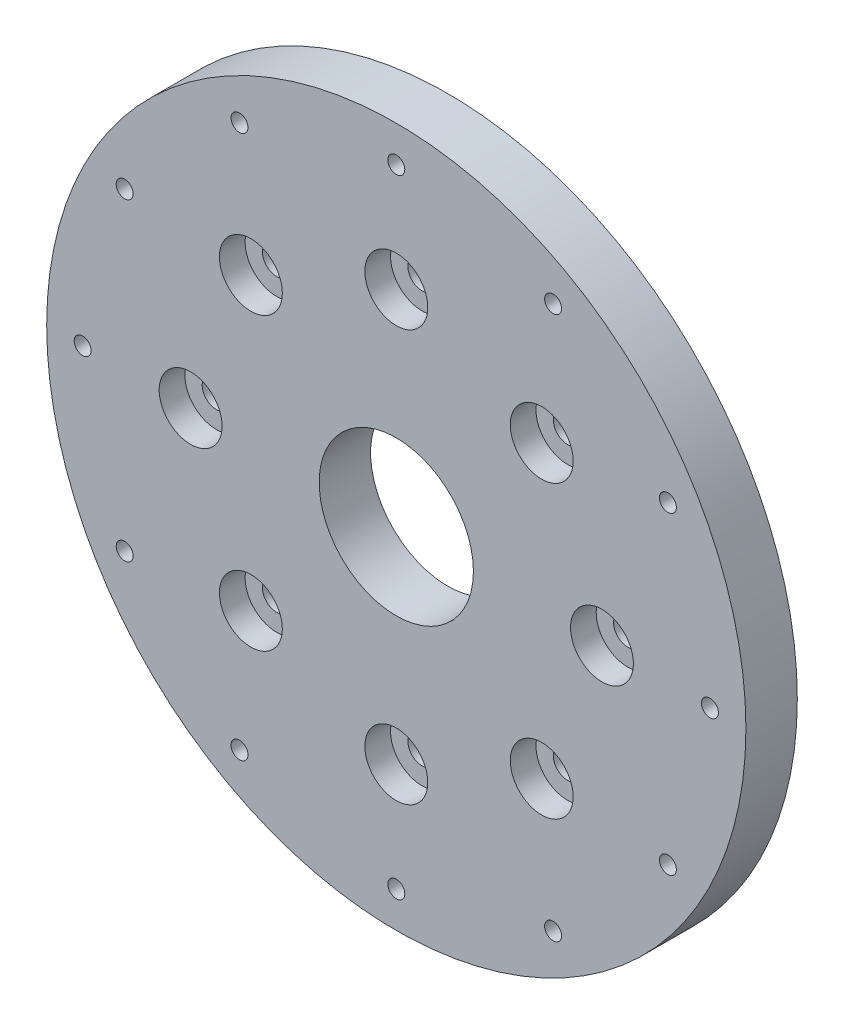
ISO-10303-21;
HEADER;
FILE_DESCRIPTION(('STEP AP214'),'2;1');
FILE_NAME('part.step','',(''),(''),'','','');
FILE_SCHEMA(('AUTOMOTIVE_DESIGN { 1 0 10303 214 1 1 1 1 }'));
ENDSEC;
DATA;
#1=APPLICATION_CONTEXT('core data for automotive mechanical design processes');
#2=APPLICATION_PROTOCOL_DEFINITION('international standard','automotive_design',2000,#1);
#3=PRODUCT_CONTEXT('',#1,'mechanical');
#4=PRODUCT('Part','Part','',(#3));
#5=PRODUCT_RELATED_PRODUCT_CATEGORY('part','',(#4));
#6=PRODUCT_DEFINITION_FORMATION('','',#4);
#7=PRODUCT_DEFINITION_CONTEXT('part definition',#1,'design');
#8=PRODUCT_DEFINITION('design','',#6,#7);
#9=PRODUCT_DEFINITION_SHAPE('','',#8);
#10=(LENGTH_UNIT() NAMED_UNIT(*) SI_UNIT(.MILLI.,.METRE.));
#11=(NAMED_UNIT(*) PLANE_ANGLE_UNIT() SI_UNIT($,.RADIAN.));
#12=(NAMED_UNIT(*) SI_UNIT($,.STERADIAN.) SOLID_ANGLE_UNIT());
#13=UNCERTAINTY_MEASURE_WITH_UNIT(LENGTH_MEASURE(1.E-05),#10,'distance_accuracy_value','');
#14=(GEOMETRIC_REPRESENTATION_CONTEXT(3) GLOBAL_UNCERTAINTY_ASSIGNED_CONTEXT((#13)) GLOBAL_UNIT_ASSIGNED_CONTEXT((#10,
#11,#12)) REPRESENTATION_CONTEXT('',''));
#15=CARTESIAN_POINT('',(0.,0.,0.));
#16=DIRECTION('',(0.,0.,1.));
#17=DIRECTION('',(1.,0.,0.));
#18=AXIS2_PLACEMENT_3D('',#15,#16,#17);
#19=CARTESIAN_POINT('',(0.,40.,10.));
#20=DIRECTION('',(0.,0.,1.));
#21=DIRECTION('',(1.,0.,0.));
#22=AXIS2_PLACEMENT_3D('',#19,#20,#21);
#23=CYLINDRICAL_SURFACE('',#22,2.75);
#24=CARTESIAN_POINT('',(0.,40.,0.));
#25=DIRECTION('',(0.,0.,1.));
#26=DIRECTION('',(1.,0.,0.));
#27=AXIS2_PLACEMENT_3D('',#24,#25,#26);
#28=CIRCLE('',#27,2.75);
#29=CARTESIAN_POINT('',(2.75,40.,0.));
#30=VERTEX_POINT('',#29);
#31=EDGE_CURVE('E124',#30,#30,#28,.T.);
#32=ORIENTED_EDGE('',*,*,#31,.F.);
#33=EDGE_LOOP('',(#32));
#34=FACE_BOUND('',#33,.T.);
#35=CARTESIAN_POINT('',(0.,40.,5.));
#36=DIRECTION('',(0.,0.,1.));
#37=DIRECTION('',(1.,0.,0.));
#38=AXIS2_PLACEMENT_3D('',#35,#36,#37);
#39=CIRCLE('',#38,2.75);
#40=CARTESIAN_POINT('',(2.75,40.,5.));
#41=VERTEX_POINT('',#40);
#42=EDGE_CURVE('E38',#41,#41,#39,.F.);
#43=ORIENTED_EDGE('',*,*,#42,.F.);
#44=EDGE_LOOP('',(#43));
#45=FACE_BOUND('',#44,.T.);
#46=ADVANCED_FACE('F34',(#34,#45),#23,.F.);
#47=CARTESIAN_POINT('',(-28.2842712474619,28.2842712474619,10.));
#48=DIRECTION('',(0.,0.,1.));
#49=DIRECTION('',(1.,0.,0.));
#50=AXIS2_PLACEMENT_3D('',#47,#48,#49);
#51=CYLINDRICAL_SURFACE('',#50,2.75);
#52=CARTESIAN_POINT('',(-28.2842712474619,28.2842712474619,0.));
#53=DIRECTION('',(0.,0.,1.));
#54=DIRECTION('',(1.,0.,0.));
#55=AXIS2_PLACEMENT_3D('',#52,#53,#54);
#56=CIRCLE('',#55,2.75);
#57=CARTESIAN_POINT('',(-25.5342712474619,28.2842712474619,0.));
#58=VERTEX_POINT('',#57);
#59=EDGE_CURVE('E118',#58,#58,#56,.T.);
#60=ORIENTED_EDGE('',*,*,#59,.F.);
#61=EDGE_LOOP('',(#60));
#62=FACE_BOUND('',#61,.T.);
#63=CARTESIAN_POINT('',(-28.2842712474619,28.2842712474619,5.));
#64=DIRECTION('',(0.,0.,1.));
#65=DIRECTION('',(1.,0.,0.));
#66=AXIS2_PLACEMENT_3D('',#63,#64,#65);
#67=CIRCLE('',#66,2.75);
#68=CARTESIAN_POINT('',(-25.5342712474619,28.2842712474619,5.));
#69=VERTEX_POINT('',#68);
#70=EDGE_CURVE('E73',#69,#69,#67,.F.);
#71=ORIENTED_EDGE('',*,*,#70,.F.);
#72=EDGE_LOOP('',(#71));
#73=FACE_BOUND('',#72,.T.);
#74=ADVANCED_FACE('F170',(#62,#73),#51,.F.);
#75=CARTESIAN_POINT('',(-40.,-1.38777878078145E-13,10.));
#76=DIRECTION('',(0.,0.,1.));
#77=DIRECTION('',(1.,0.,0.));
#78=AXIS2_PLACEMENT_3D('',#75,#76,#77);
#79=CYLINDRICAL_SURFACE('',#78,2.75);
#80=CARTESIAN_POINT('',(-40.,-1.38777878078145E-13,0.));
#81=DIRECTION('',(0.,0.,1.));
#82=DIRECTION('',(1.,0.,0.));
#83=AXIS2_PLACEMENT_3D('',#80,#81,#82);
#84=CIRCLE('',#83,2.75);
#85=CARTESIAN_POINT('',(-37.25,-1.38777878078145E-13,0.));
#86=VERTEX_POINT('',#85);
#87=EDGE_CURVE('E112',#86,#86,#84,.T.);
#88=ORIENTED_EDGE('',*,*,#87,.F.);
#89=EDGE_LOOP('',(#88));
#90=FACE_BOUND('',#89,.T.);
#91=CARTESIAN_POINT('',(-40.,-1.38777878078145E-13,5.));
#92=DIRECTION('',(0.,0.,1.));
#93=DIRECTION('',(1.,0.,0.));
#94=AXIS2_PLACEMENT_3D('',#91,#92,#93);
#95=CIRCLE('',#94,2.75);
#96=CARTESIAN_POINT('',(-37.25,-1.38777878078145E-13,5.));
#97=VERTEX_POINT('',#96);
#98=EDGE_CURVE('E71',#97,#97,#95,.F.);
#99=ORIENTED_EDGE('',*,*,#98,.F.);
#100=EDGE_LOOP('',(#99));
#101=FACE_BOUND('',#100,.T.);
#102=ADVANCED_FACE('F176',(#90,#101),#79,.F.);
#103=CARTESIAN_POINT('',(-28.284271247462,-28.2842712474618,10.));
#104=DIRECTION('',(0.,0.,1.));
#105=DIRECTION('',(1.,0.,0.));
#106=AXIS2_PLACEMENT_3D('',#103,#104,#105);
#107=CYLINDRICAL_SURFACE('',#106,2.75);
#108=CARTESIAN_POINT('',(-28.284271247462,-28.2842712474618,0.));
#109=DIRECTION('',(0.,0.,1.));
#110=DIRECTION('',(1.,0.,0.));
#111=AXIS2_PLACEMENT_3D('',#108,#109,#110);
#112=CIRCLE('',#111,2.75);
#113=CARTESIAN_POINT('',(-25.534271247462,-28.2842712474618,0.));
#114=VERTEX_POINT('',#113);
#115=EDGE_CURVE('E106',#114,#114,#112,.T.);
#116=ORIENTED_EDGE('',*,*,#115,.F.);
#117=EDGE_LOOP('',(#116));
#118=FACE_BOUND('',#117,.T.);
#119=CARTESIAN_POINT('',(-28.284271247462,-28.2842712474618,5.));
#120=DIRECTION('',(0.,0.,1.));
#121=DIRECTION('',(1.,0.,0.));
#122=AXIS2_PLACEMENT_3D('',#119,#120,#121);
#123=CIRCLE('',#122,2.75);
#124=CARTESIAN_POINT('',(-25.534271247462,-28.2842712474618,5.));
#125=VERTEX_POINT('',#124);
#126=EDGE_CURVE('E68',#125,#125,#123,.F.);
#127=ORIENTED_EDGE('',*,*,#126,.F.);
#128=EDGE_LOOP('',(#127));
#129=FACE_BOUND('',#128,.T.);
#130=ADVANCED_FACE('F241',(#118,#129),#107,.F.);
#131=CARTESIAN_POINT('',(2.77555756156289E-13,-40.,10.));
#132=DIRECTION('',(0.,0.,1.));
#133=DIRECTION('',(1.,0.,0.));
#134=AXIS2_PLACEMENT_3D('',#131,#132,#133);
#135=CYLINDRICAL_SURFACE('',#134,2.75);
#136=CARTESIAN_POINT('',(2.77555756156289E-13,-40.,0.));
#137=DIRECTION('',(0.,0.,1.));
#138=DIRECTION('',(1.,0.,0.));
#139=AXIS2_PLACEMENT_3D('',#136,#137,#138);
#140=CIRCLE('',#139,2.75);
#141=CARTESIAN_POINT('',(2.75000000000028,-40.,0.));
#142=VERTEX_POINT('',#141);
#143=EDGE_CURVE('E100',#142,#142,#140,.T.);
#144=ORIENTED_EDGE('',*,*,#143,.F.);
#145=EDGE_LOOP('',(#144));
#146=FACE_BOUND('',#145,.T.);
#147=CARTESIAN_POINT('',(2.77555756156289E-13,-40.,5.));
#148=DIRECTION('',(0.,0.,1.));
#149=DIRECTION('',(1.,0.,0.));
#150=AXIS2_PLACEMENT_3D('',#147,#148,#149);
#151=CIRCLE('',#150,2.75);
#152=CARTESIAN_POINT('',(2.75000000000028,-40.,5.));
#153=VERTEX_POINT('',#152);
#154=EDGE_CURVE('E65',#153,#153,#151,.F.);
#155=ORIENTED_EDGE('',*,*,#154,.F.);
#156=EDGE_LOOP('',(#155));
#157=FACE_BOUND('',#156,.T.);
#158=ADVANCED_FACE('F289',(#146,#157),#135,.F.);
#159=CARTESIAN_POINT('',(28.2842712474621,-28.2842712474617,10.));
#160=DIRECTION('',(0.,0.,1.));
#161=DIRECTION('',(1.,0.,0.));
#162=AXIS2_PLACEMENT_3D('',#159,#160,#161);
#163=CYLINDRICAL_SURFACE('',#162,2.75);
#164=CARTESIAN_POINT('',(28.2842712474621,-28.2842712474617,0.));
#165=DIRECTION('',(0.,0.,1.));
#166=DIRECTION('',(1.,0.,0.));
#167=AXIS2_PLACEMENT_3D('',#164,#165,#166);
#168=CIRCLE('',#167,2.75);
#169=CARTESIAN_POINT('',(31.0342712474621,-28.2842712474617,0.));
#170=VERTEX_POINT('',#169);
#171=EDGE_CURVE('E94',#170,#170,#168,.T.);
#172=ORIENTED_EDGE('',*,*,#171,.F.);
#173=EDGE_LOOP('',(#172));
#174=FACE_BOUND('',#173,.T.);
#175=CARTESIAN_POINT('',(28.2842712474621,-28.2842712474617,5.));
#176=DIRECTION('',(0.,0.,1.));
#177=DIRECTION('',(1.,0.,0.));
#178=AXIS2_PLACEMENT_3D('',#175,#176,#177);
#179=CIRCLE('',#178,2.75);
#180=CARTESIAN_POINT('',(31.0342712474621,-28.2842712474617,5.));
#181=VERTEX_POINT('',#180);
#182=EDGE_CURVE('E61',#181,#181,#179,.F.);
#183=ORIENTED_EDGE('',*,*,#182,.F.);
#184=EDGE_LOOP('',(#183));
#185=FACE_BOUND('',#184,.T.);
#186=ADVANCED_FACE('F205',(#174,#185),#163,.F.);
#187=CARTESIAN_POINT('',(40.,4.1286418728248E-13,10.));
#188=DIRECTION('',(0.,0.,1.));
#189=DIRECTION('',(1.,0.,0.));
#190=AXIS2_PLACEMENT_3D('',#187,#188,#189);
#191=CYLINDRICAL_SURFACE('',#190,2.75);
#192=CARTESIAN_POINT('',(40.,4.1286418728248E-13,0.));
#193=DIRECTION('',(0.,0.,1.));
#194=DIRECTION('',(1.,0.,0.));
#195=AXIS2_PLACEMENT_3D('',#192,#193,#194);
#196=CIRCLE('',#195,2.75);
#197=CARTESIAN_POINT('',(42.75,4.1286418728248E-13,0.));
#198=VERTEX_POINT('',#197);
#199=EDGE_CURVE('E82',#198,#198,#196,.T.);
#200=ORIENTED_EDGE('',*,*,#199,.F.);
#201=EDGE_LOOP('',(#200));
#202=FACE_BOUND('',#201,.T.);
#203=CARTESIAN_POINT('',(40.,4.1286418728248E-13,5.));
#204=DIRECTION('',(0.,0.,1.));
#205=DIRECTION('',(1.,0.,0.));
#206=AXIS2_PLACEMENT_3D('',#203,#204,#205);
#207=CIRCLE('',#206,2.75);
#208=CARTESIAN_POINT('',(42.75,4.1286418728248E-13,5.));
#209=VERTEX_POINT('',#208);
#210=EDGE_CURVE('E58',#209,#209,#207,.F.);
#211=ORIENTED_EDGE('',*,*,#210,.F.);
#212=EDGE_LOOP('',(#211));
#213=FACE_BOUND('',#212,.T.);
#214=ADVANCED_FACE('F198',(#202,#213),#191,.F.);
#215=CARTESIAN_POINT('',(28.284271247462,28.2842712474618,10.));
#216=DIRECTION('',(0.,0.,1.));
#217=DIRECTION('',(1.,0.,0.));
#218=AXIS2_PLACEMENT_3D('',#215,#216,#217);
#219=CYLINDRICAL_SURFACE('',#218,2.75);
#220=CARTESIAN_POINT('',(28.284271247462,28.2842712474618,0.));
#221=DIRECTION('',(0.,0.,1.));
#222=DIRECTION('',(1.,0.,0.));
#223=AXIS2_PLACEMENT_3D('',#220,#221,#222);
#224=CIRCLE('',#223,2.75);
#225=CARTESIAN_POINT('',(31.034271247462,28.2842712474618,0.));
#226=VERTEX_POINT('',#225);
#227=EDGE_CURVE('E137',#226,#226,#224,.T.);
#228=ORIENTED_EDGE('',*,*,#227,.F.);
#229=EDGE_LOOP('',(#228));
#230=FACE_BOUND('',#229,.T.);
#231=CARTESIAN_POINT('',(28.284271247462,28.2842712474618,5.));
#232=DIRECTION('',(0.,0.,1.));
#233=DIRECTION('',(1.,0.,0.));
#234=AXIS2_PLACEMENT_3D('',#231,#232,#233);
#235=CIRCLE('',#234,2.75);
#236=CARTESIAN_POINT('',(31.034271247462,28.2842712474618,5.));
#237=VERTEX_POINT('',#236);
#238=EDGE_CURVE('E53',#237,#237,#235,.F.);
#239=ORIENTED_EDGE('',*,*,#238,.F.);
#240=EDGE_LOOP('',(#239));
#241=FACE_BOUND('',#240,.T.);
#242=ADVANCED_FACE('F195',(#230,#241),#219,.F.);
#243=CARTESIAN_POINT('',(0.,0.,10.));
#244=DIRECTION('',(0.,0.,1.));
#245=DIRECTION('',(1.,0.,0.));
#246=AXIS2_PLACEMENT_3D('',#243,#244,#245);
#247=PLANE('',#246);
#248=CARTESIAN_POINT('',(30.4999999999993,52.8275496308511,10.));
#249=DIRECTION('',(0.,0.,1.));
#250=DIRECTION('',(1.,0.,0.));
#251=AXIS2_PLACEMENT_3D('',#248,#249,#250);
#252=CIRCLE('',#251,1.65);
#253=CARTESIAN_POINT('',(32.1499999999993,52.8275496308511,10.));
#254=VERTEX_POINT('',#253);
#255=EDGE_CURVE('E410',#254,#254,#252,.T.);
#256=ORIENTED_EDGE('',*,*,#255,.F.);
#257=EDGE_LOOP('',(#256));
#258=FACE_BOUND('',#257,.T.);
#259=CARTESIAN_POINT('',(52.8275496308503,30.5000000000006,10.));
#260=DIRECTION('',(0.,0.,1.));
#261=DIRECTION('',(1.,0.,0.));
#262=AXIS2_PLACEMENT_3D('',#259,#260,#261);
#263=CIRCLE('',#262,1.65);
#264=CARTESIAN_POINT('',(54.4775496308503,30.5000000000006,10.));
#265=VERTEX_POINT('',#264);
#266=EDGE_CURVE('E404',#265,#265,#263,.T.);
#267=ORIENTED_EDGE('',*,*,#266,.F.);
#268=EDGE_LOOP('',(#267));
#269=FACE_BOUND('',#268,.T.);
#270=CARTESIAN_POINT('',(60.9999999999999,6.38941085008293E-13,10.));
#271=DIRECTION('',(0.,0.,1.));
#272=DIRECTION('',(1.,0.,0.));
#273=AXIS2_PLACEMENT_3D('',#270,#271,#272);
#274=CIRCLE('',#273,1.65);
#275=CARTESIAN_POINT('',(62.6499999999999,6.38941085008293E-13,10.));
#276=VERTEX_POINT('',#275);
#277=EDGE_CURVE('E398',#276,#276,#274,.T.);
#278=ORIENTED_EDGE('',*,*,#277,.F.);
#279=EDGE_LOOP('',(#278));
#280=FACE_BOUND('',#279,.T.);
#281=CARTESIAN_POINT('',(52.827549630851,-30.4999999999995,10.));
#282=DIRECTION('',(0.,0.,1.));
#283=DIRECTION('',(1.,0.,0.));
#284=AXIS2_PLACEMENT_3D('',#281,#282,#283);
#285=CIRCLE('',#284,1.65);
#286=CARTESIAN_POINT('',(54.477549630851,-30.4999999999995,10.));
#287=VERTEX_POINT('',#286);
#288=EDGE_CURVE('E392',#287,#287,#285,.T.);
#289=ORIENTED_EDGE('',*,*,#288,.F.);
#290=EDGE_LOOP('',(#289));
#291=FACE_BOUND('',#290,.T.);
#292=CARTESIAN_POINT('',(30.5000000000004,-52.8275496308505,10.));
#293=DIRECTION('',(0.,0.,1.));
#294=DIRECTION('',(1.,0.,0.));
#295=AXIS2_PLACEMENT_3D('',#292,#293,#294);
#296=CIRCLE('',#295,1.65);
#297=CARTESIAN_POINT('',(32.1500000000004,-52.8275496308505,10.));
#298=VERTEX_POINT('',#297);
#299=EDGE_CURVE('E386',#298,#298,#296,.T.);
#300=ORIENTED_EDGE('',*,*,#299,.F.);
#301=EDGE_LOOP('',(#300));
#302=FACE_BOUND('',#301,.T.);
#303=CARTESIAN_POINT('',(0.,-60.9999999999999,10.));
#304=DIRECTION('',(0.,0.,1.));
#305=DIRECTION('',(1.,0.,0.));
#306=AXIS2_PLACEMENT_3D('',#303,#304,#305);
#307=CIRCLE('',#306,1.65);
#308=CARTESIAN_POINT('',(1.65,-60.9999999999999,10.));
#309=VERTEX_POINT('',#308);
#310=EDGE_CURVE('E380',#309,#309,#307,.T.);
#311=ORIENTED_EDGE('',*,*,#310,.F.);
#312=EDGE_LOOP('',(#311));
#313=FACE_BOUND('',#312,.T.);
#314=CARTESIAN_POINT('',(-30.4999999999997,-52.8275496308509,10.));
#315=DIRECTION('',(0.,0.,1.));
#316=DIRECTION('',(1.,0.,0.));
#317=AXIS2_PLACEMENT_3D('',#314,#315,#316);
#318=CIRCLE('',#317,1.65);
#319=CARTESIAN_POINT('',(-28.8499999999997,-52.8275496308509,10.));
#320=VERTEX_POINT('',#319);
#321=EDGE_CURVE('E374',#320,#320,#318,.T.);
#322=ORIENTED_EDGE('',*,*,#321,.F.);
#323=EDGE_LOOP('',(#322));
#324=FACE_BOUND('',#323,.T.);
#325=CARTESIAN_POINT('',(-52.8275496308506,-30.5000000000002,10.));
#326=DIRECTION('',(0.,0.,1.));
#327=DIRECTION('',(1.,0.,0.));
#328=AXIS2_PLACEMENT_3D('',#325,#326,#327);
#329=CIRCLE('',#328,1.65);
#330=CARTESIAN_POINT('',(-51.1775496308506,-30.5000000000002,10.));
#331=VERTEX_POINT('',#330);
#332=EDGE_CURVE('E368',#331,#331,#329,.T.);
#333=ORIENTED_EDGE('',*,*,#332,.F.);
#334=EDGE_LOOP('',(#333));
#335=FACE_BOUND('',#334,.T.);
#336=CARTESIAN_POINT('',(-60.9999999999999,-2.12980361669431E-13,10.));
#337=DIRECTION('',(0.,0.,1.));
#338=DIRECTION('',(1.,0.,0.));
#339=AXIS2_PLACEMENT_3D('',#336,#337,#338);
#340=CIRCLE('',#339,1.65);
#341=CARTESIAN_POINT('',(-59.3499999999999,-2.12980361669431E-13,10.));
#342=VERTEX_POINT('',#341);
#343=EDGE_CURVE('E362',#342,#342,#340,.T.);
#344=ORIENTED_EDGE('',*,*,#343,.F.);
#345=EDGE_LOOP('',(#344));
#346=FACE_BOUND('',#345,.T.);
#347=CARTESIAN_POINT('',(-52.8275496308508,30.4999999999999,10.));
#348=DIRECTION('',(0.,0.,1.));
#349=DIRECTION('',(1.,0.,0.));
#350=AXIS2_PLACEMENT_3D('',#347,#348,#349);
#351=CIRCLE('',#350,1.65);
#352=CARTESIAN_POINT('',(-51.1775496308508,30.4999999999999,10.));
#353=VERTEX_POINT('',#352);
#354=EDGE_CURVE('E356',#353,#353,#351,.T.);
#355=ORIENTED_EDGE('',*,*,#354,.F.);
#356=EDGE_LOOP('',(#355));
#357=FACE_BOUND('',#356,.T.);
#358=CARTESIAN_POINT('',(-30.5,52.8275496308507,10.));
#359=DIRECTION('',(0.,0.,1.));
#360=DIRECTION('',(1.,0.,0.));
#361=AXIS2_PLACEMENT_3D('',#358,#359,#360);
#362=CIRCLE('',#361,1.65);
#363=CARTESIAN_POINT('',(-28.85,52.8275496308507,10.));
#364=VERTEX_POINT('',#363);
#365=EDGE_CURVE('E348',#364,#364,#362,.T.);
#366=ORIENTED_EDGE('',*,*,#365,.F.);
#367=EDGE_LOOP('',(#366));
#368=FACE_BOUND('',#367,.T.);
#369=CARTESIAN_POINT('',(0.,60.9999999999999,10.));
#370=DIRECTION('',(0.,0.,1.));
#371=DIRECTION('',(1.,0.,0.));
#372=AXIS2_PLACEMENT_3D('',#369,#370,#371);
#373=CIRCLE('',#372,1.65);
#374=CARTESIAN_POINT('',(1.65,60.9999999999999,10.));
#375=VERTEX_POINT('',#374);
#376=EDGE_CURVE('E340',#375,#375,#373,.T.);
#377=ORIENTED_EDGE('',*,*,#376,.F.);
#378=EDGE_LOOP('',(#377));
#379=FACE_BOUND('',#378,.T.);
#380=CARTESIAN_POINT('',(40.,4.1286418728248E-13,10.));
#381=DIRECTION('',(0.,0.,1.));
#382=DIRECTION('',(1.,0.,0.));
#383=AXIS2_PLACEMENT_3D('',#380,#381,#382);
#384=CIRCLE('',#383,6.11899999999999);
#385=CARTESIAN_POINT('',(46.119,4.1286418728248E-13,10.));
#386=VERTEX_POINT('',#385);
#387=EDGE_CURVE('E78',#386,#386,#384,.T.);
#388=ORIENTED_EDGE('',*,*,#387,.F.);
#389=EDGE_LOOP('',(#388));
#390=FACE_BOUND('',#389,.T.);
#391=CARTESIAN_POINT('',(28.2842712474621,-28.2842712474617,10.));
#392=DIRECTION('',(0.,0.,1.));
#393=DIRECTION('',(1.,0.,0.));
#394=AXIS2_PLACEMENT_3D('',#391,#392,#393);
#395=CIRCLE('',#394,6.119);
#396=CARTESIAN_POINT('',(34.4032712474621,-28.2842712474617,10.));
#397=VERTEX_POINT('',#396);
#398=EDGE_CURVE('E87',#397,#397,#395,.T.);
#399=ORIENTED_EDGE('',*,*,#398,.F.);
#400=EDGE_LOOP('',(#399));
#401=FACE_BOUND('',#400,.T.);
#402=CARTESIAN_POINT('',(2.77555756156289E-13,-40.,10.));
#403=DIRECTION('',(0.,0.,1.));
#404=DIRECTION('',(1.,0.,0.));
#405=AXIS2_PLACEMENT_3D('',#402,#403,#404);
#406=CIRCLE('',#405,6.119);
#407=CARTESIAN_POINT('',(6.11900000000027,-40.,10.));
#408=VERTEX_POINT('',#407);
#409=EDGE_CURVE('E97',#408,#408,#406,.T.);
#410=ORIENTED_EDGE('',*,*,#409,.F.);
#411=EDGE_LOOP('',(#410));
#412=FACE_BOUND('',#411,.T.);
#413=CARTESIAN_POINT('',(-28.284271247462,-28.2842712474618,10.));
#414=DIRECTION('',(0.,0.,1.));
#415=DIRECTION('',(1.,0.,0.));
#416=AXIS2_PLACEMENT_3D('',#413,#414,#415);
#417=CIRCLE('',#416,6.119);
#418=CARTESIAN_POINT('',(-22.165271247462,-28.2842712474618,10.));
#419=VERTEX_POINT('',#418);
#420=EDGE_CURVE('E103',#419,#419,#417,.T.);
#421=ORIENTED_EDGE('',*,*,#420,.F.);
#422=EDGE_LOOP('',(#421));
#423=FACE_BOUND('',#422,.T.);
#424=CARTESIAN_POINT('',(-40.,-1.38777878078145E-13,10.));
#425=DIRECTION('',(0.,0.,1.));
#426=DIRECTION('',(1.,0.,0.));
#427=AXIS2_PLACEMENT_3D('',#424,#425,#426);
#428=CIRCLE('',#427,6.11899999999999);
#429=CARTESIAN_POINT('',(-33.881,-1.38777878078145E-13,10.));
#430=VERTEX_POINT('',#429);
#431=EDGE_CURVE('E109',#430,#430,#428,.T.);
#432=ORIENTED_EDGE('',*,*,#431,.F.);
#433=EDGE_LOOP('',(#432));
#434=FACE_BOUND('',#433,.T.);
#435=CARTESIAN_POINT('',(-28.2842712474619,28.2842712474619,10.));
#436=DIRECTION('',(0.,0.,1.));
#437=DIRECTION('',(1.,0.,0.));
#438=AXIS2_PLACEMENT_3D('',#435,#436,#437);
#439=CIRCLE('',#438,6.119);
#440=CARTESIAN_POINT('',(-22.165271247462,28.2842712474619,10.));
#441=VERTEX_POINT('',#440);
#442=EDGE_CURVE('E115',#441,#441,#439,.T.);
#443=ORIENTED_EDGE('',*,*,#442,.F.);
#444=EDGE_LOOP('',(#443));
#445=FACE_BOUND('',#444,.T.);
#446=CARTESIAN_POINT('',(0.,40.,10.));
#447=DIRECTION('',(0.,0.,1.));
#448=DIRECTION('',(1.,0.,0.));
#449=AXIS2_PLACEMENT_3D('',#446,#447,#448);
#450=CIRCLE('',#449,6.119);
#451=CARTESIAN_POINT('',(6.119,40.,10.));
#452=VERTEX_POINT('',#451);
#453=EDGE_CURVE('E121',#452,#452,#450,.T.);
#454=ORIENTED_EDGE('',*,*,#453,.F.);
#455=EDGE_LOOP('',(#454));
#456=FACE_BOUND('',#455,.T.);
#457=CARTESIAN_POINT('',(0.,0.,10.));
#458=DIRECTION('',(0.,0.,1.));
#459=DIRECTION('',(1.,0.,0.));
#460=AXIS2_PLACEMENT_3D('',#457,#458,#459);
#461=CIRCLE('',#460,15.);
#462=CARTESIAN_POINT('',(15.,0.,10.));
#463=VERTEX_POINT('',#462);
#464=EDGE_CURVE('E42',#463,#463,#461,.T.);
#465=ORIENTED_EDGE('',*,*,#464,.F.);
#466=EDGE_LOOP('',(#465));
#467=FACE_BOUND('',#466,.T.);
#468=CARTESIAN_POINT('',(28.284271247462,28.2842712474618,10.));
#469=DIRECTION('',(0.,0.,1.));
#470=DIRECTION('',(1.,0.,0.));
#471=AXIS2_PLACEMENT_3D('',#468,#469,#470);
#472=CIRCLE('',#471,6.119);
#473=CARTESIAN_POINT('',(34.403271247462,28.2842712474618,10.));
#474=VERTEX_POINT('',#473);
#475=EDGE_CURVE('E132',#474,#474,#472,.T.);
#476=ORIENTED_EDGE('',*,*,#475,.F.);
#477=EDGE_LOOP('',(#476));
#478=FACE_BOUND('',#477,.T.);
#479=CARTESIAN_POINT('',(0.,0.,10.));
#480=DIRECTION('',(0.,0.,1.));
#481=DIRECTION('',(1.,0.,0.));
#482=AXIS2_PLACEMENT_3D('',#479,#480,#481);
#483=CIRCLE('',#482,68.);
#484=CARTESIAN_POINT('',(68.,0.,10.));
#485=VERTEX_POINT('',#484);
#486=EDGE_CURVE('E56',#485,#485,#483,.T.);
#487=ORIENTED_EDGE('',*,*,#486,.T.);
#488=EDGE_LOOP('',(#487));
#489=FACE_BOUND('',#488,.T.);
#490=ADVANCED_FACE('F197',(#258,#269,#280,#291,#302,#313,#324,#335,#346,#357,#368,#379,#390,
#401,#412,#423,#434,#445,#456,#467,#478,#489),#247,.T.);
#491=CARTESIAN_POINT('',(0.,0.,0.));
#492=DIRECTION('',(0.,0.,1.));
#493=DIRECTION('',(1.,0.,0.));
#494=AXIS2_PLACEMENT_3D('',#491,#492,#493);
#495=PLANE('',#494);
#496=CARTESIAN_POINT('',(30.4999999999993,52.8275496308511,0.));
#497=DIRECTION('',(0.,0.,1.));
#498=DIRECTION('',(1.,0.,0.));
#499=AXIS2_PLACEMENT_3D('',#496,#497,#498);
#500=CIRCLE('',#499,1.65);
#501=CARTESIAN_POINT('',(32.1499999999993,52.8275496308511,0.));
#502=VERTEX_POINT('',#501);
#503=EDGE_CURVE('E407',#502,#502,#500,.T.);
#504=ORIENTED_EDGE('',*,*,#503,.T.);
#505=EDGE_LOOP('',(#504));
#506=FACE_BOUND('',#505,.T.);
#507=CARTESIAN_POINT('',(52.8275496308503,30.5000000000006,0.));
#508=DIRECTION('',(0.,0.,1.));
#509=DIRECTION('',(1.,0.,0.));
#510=AXIS2_PLACEMENT_3D('',#507,#508,#509);
#511=CIRCLE('',#510,1.65);
#512=CARTESIAN_POINT('',(54.4775496308503,30.5000000000006,0.));
#513=VERTEX_POINT('',#512);
#514=EDGE_CURVE('E401',#513,#513,#511,.T.);
#515=ORIENTED_EDGE('',*,*,#514,.T.);
#516=EDGE_LOOP('',(#515));
#517=FACE_BOUND('',#516,.T.);
#518=CARTESIAN_POINT('',(60.9999999999999,6.38941085008293E-13,0.));
#519=DIRECTION('',(0.,0.,1.));
#520=DIRECTION('',(1.,0.,0.));
#521=AXIS2_PLACEMENT_3D('',#518,#519,#520);
#522=CIRCLE('',#521,1.65);
#523=CARTESIAN_POINT('',(62.6499999999999,6.38941085008293E-13,0.));
#524=VERTEX_POINT('',#523);
#525=EDGE_CURVE('E395',#524,#524,#522,.T.);
#526=ORIENTED_EDGE('',*,*,#525,.T.);
#527=EDGE_LOOP('',(#526));
#528=FACE_BOUND('',#527,.T.);
#529=CARTESIAN_POINT('',(52.827549630851,-30.4999999999995,0.));
#530=DIRECTION('',(0.,0.,1.));
#531=DIRECTION('',(1.,0.,0.));
#532=AXIS2_PLACEMENT_3D('',#529,#530,#531);
#533=CIRCLE('',#532,1.65);
#534=CARTESIAN_POINT('',(54.477549630851,-30.4999999999995,0.));
#535=VERTEX_POINT('',#534);
#536=EDGE_CURVE('E389',#535,#535,#533,.T.);
#537=ORIENTED_EDGE('',*,*,#536,.T.);
#538=EDGE_LOOP('',(#537));
#539=FACE_BOUND('',#538,.T.);
#540=CARTESIAN_POINT('',(30.5000000000004,-52.8275496308505,0.));
#541=DIRECTION('',(0.,0.,1.));
#542=DIRECTION('',(1.,0.,0.));
#543=AXIS2_PLACEMENT_3D('',#540,#541,#542);
#544=CIRCLE('',#543,1.65);
#545=CARTESIAN_POINT('',(32.1500000000004,-52.8275496308505,0.));
#546=VERTEX_POINT('',#545);
#547=EDGE_CURVE('E383',#546,#546,#544,.T.);
#548=ORIENTED_EDGE('',*,*,#547,.T.);
#549=EDGE_LOOP('',(#548));
#550=FACE_BOUND('',#549,.T.);
#551=CARTESIAN_POINT('',(0.,-60.9999999999999,0.));
#552=DIRECTION('',(0.,0.,1.));
#553=DIRECTION('',(1.,0.,0.));
#554=AXIS2_PLACEMENT_3D('',#551,#552,#553);
#555=CIRCLE('',#554,1.65);
#556=CARTESIAN_POINT('',(1.65,-60.9999999999999,0.));
#557=VERTEX_POINT('',#556);
#558=EDGE_CURVE('E377',#557,#557,#555,.T.);
#559=ORIENTED_EDGE('',*,*,#558,.T.);
#560=EDGE_LOOP('',(#559));
#561=FACE_BOUND('',#560,.T.);
#562=CARTESIAN_POINT('',(-30.4999999999997,-52.8275496308509,0.));
#563=DIRECTION('',(0.,0.,1.));
#564=DIRECTION('',(1.,0.,0.));
#565=AXIS2_PLACEMENT_3D('',#562,#563,#564);
#566=CIRCLE('',#565,1.65);
#567=CARTESIAN_POINT('',(-28.8499999999997,-52.8275496308509,0.));
#568=VERTEX_POINT('',#567);
#569=EDGE_CURVE('E371',#568,#568,#566,.T.);
#570=ORIENTED_EDGE('',*,*,#569,.T.);
#571=EDGE_LOOP('',(#570));
#572=FACE_BOUND('',#571,.T.);
#573=CARTESIAN_POINT('',(-52.8275496308506,-30.5000000000002,0.));
#574=DIRECTION('',(0.,0.,1.));
#575=DIRECTION('',(1.,0.,0.));
#576=AXIS2_PLACEMENT_3D('',#573,#574,#575);
#577=CIRCLE('',#576,1.65);
#578=CARTESIAN_POINT('',(-51.1775496308506,-30.5000000000002,0.));
#579=VERTEX_POINT('',#578);
#580=EDGE_CURVE('E365',#579,#579,#577,.T.);
#581=ORIENTED_EDGE('',*,*,#580,.T.);
#582=EDGE_LOOP('',(#581));
#583=FACE_BOUND('',#582,.T.);
#584=CARTESIAN_POINT('',(-60.9999999999999,-2.12980361669431E-13,0.));
#585=DIRECTION('',(0.,0.,1.));
#586=DIRECTION('',(1.,0.,0.));
#587=AXIS2_PLACEMENT_3D('',#584,#585,#586);
#588=CIRCLE('',#587,1.65);
#589=CARTESIAN_POINT('',(-59.3499999999999,-2.12980361669431E-13,0.));
#590=VERTEX_POINT('',#589);
#591=EDGE_CURVE('E359',#590,#590,#588,.T.);
#592=ORIENTED_EDGE('',*,*,#591,.T.);
#593=EDGE_LOOP('',(#592));
#594=FACE_BOUND('',#593,.T.);
#595=CARTESIAN_POINT('',(-52.8275496308508,30.4999999999999,0.));
#596=DIRECTION('',(0.,0.,1.));
#597=DIRECTION('',(1.,0.,0.));
#598=AXIS2_PLACEMENT_3D('',#595,#596,#597);
#599=CIRCLE('',#598,1.65);
#600=CARTESIAN_POINT('',(-51.1775496308508,30.4999999999999,0.));
#601=VERTEX_POINT('',#600);
#602=EDGE_CURVE('E353',#601,#601,#599,.T.);
#603=ORIENTED_EDGE('',*,*,#602,.T.);
#604=EDGE_LOOP('',(#603));
#605=FACE_BOUND('',#604,.T.);
#606=CARTESIAN_POINT('',(-30.5,52.8275496308507,0.));
#607=DIRECTION('',(0.,0.,1.));
#608=DIRECTION('',(1.,0.,0.));
#609=AXIS2_PLACEMENT_3D('',#606,#607,#608);
#610=CIRCLE('',#609,1.65);
#611=CARTESIAN_POINT('',(-28.85,52.8275496308507,0.));
#612=VERTEX_POINT('',#611);
#613=EDGE_CURVE('E344',#612,#612,#610,.T.);
#614=ORIENTED_EDGE('',*,*,#613,.T.);
#615=EDGE_LOOP('',(#614));
#616=FACE_BOUND('',#615,.T.);
#617=CARTESIAN_POINT('',(0.,60.9999999999999,0.));
#618=DIRECTION('',(0.,0.,1.));
#619=DIRECTION('',(1.,0.,0.));
#620=AXIS2_PLACEMENT_3D('',#617,#618,#619);
#621=CIRCLE('',#620,1.65);
#622=CARTESIAN_POINT('',(1.65,60.9999999999999,0.));
#623=VERTEX_POINT('',#622);
#624=EDGE_CURVE('E326',#623,#623,#621,.T.);
#625=ORIENTED_EDGE('',*,*,#624,.T.);
#626=EDGE_LOOP('',(#625));
#627=FACE_BOUND('',#626,.T.);
#628=CARTESIAN_POINT('',(0.,0.,0.));
#629=DIRECTION('',(0.,0.,1.));
#630=DIRECTION('',(1.,0.,0.));
#631=AXIS2_PLACEMENT_3D('',#628,#629,#630);
#632=CIRCLE('',#631,55.);
#633=CARTESIAN_POINT('',(55.,0.,0.));
#634=VERTEX_POINT('',#633);
#635=EDGE_CURVE('E50',#634,#634,#632,.T.);
#636=ORIENTED_EDGE('',*,*,#635,.T.);
#637=EDGE_LOOP('',(#636));
#638=FACE_BOUND('',#637,.T.);
#639=CARTESIAN_POINT('',(0.,0.,0.));
#640=DIRECTION('',(0.,0.,1.));
#641=DIRECTION('',(1.,0.,0.));
#642=AXIS2_PLACEMENT_3D('',#639,#640,#641);
#643=CIRCLE('',#642,68.);
#644=CARTESIAN_POINT('',(68.,0.,0.));
#645=VERTEX_POINT('',#644);
#646=EDGE_CURVE('E129',#645,#645,#643,.T.);
#647=ORIENTED_EDGE('',*,*,#646,.F.);
#648=EDGE_LOOP('',(#647));
#649=FACE_BOUND('',#648,.T.);
#650=ADVANCED_FACE('F36',(#506,#517,#528,#539,#550,#561,#572,#583,#594,#605,#616,#627,#638,
#649),#495,.F.);
#651=ORIENTED_EDGE('',*,*,#199,.T.);
#652=EDGE_LOOP('',(#651));
#653=FACE_BOUND('',#652,.T.);
#654=ORIENTED_EDGE('',*,*,#171,.T.);
#655=EDGE_LOOP('',(#654));
#656=FACE_BOUND('',#655,.T.);
#657=ORIENTED_EDGE('',*,*,#143,.T.);
#658=EDGE_LOOP('',(#657));
#659=FACE_BOUND('',#658,.T.);
#660=ORIENTED_EDGE('',*,*,#115,.T.);
#661=EDGE_LOOP('',(#660));
#662=FACE_BOUND('',#661,.T.);
#663=ORIENTED_EDGE('',*,*,#87,.T.);
#664=EDGE_LOOP('',(#663));
#665=FACE_BOUND('',#664,.T.);
#666=ORIENTED_EDGE('',*,*,#59,.T.);
#667=EDGE_LOOP('',(#666));
#668=FACE_BOUND('',#667,.T.);
#669=ORIENTED_EDGE('',*,*,#31,.T.);
#670=EDGE_LOOP('',(#669));
#671=FACE_BOUND('',#670,.T.);
#672=ORIENTED_EDGE('',*,*,#227,.T.);
#673=EDGE_LOOP('',(#672));
#674=FACE_BOUND('',#673,.T.);
#675=CARTESIAN_POINT('',(0.,0.,0.));
#676=DIRECTION('',(0.,0.,1.));
#677=DIRECTION('',(1.,0.,0.));
#678=AXIS2_PLACEMENT_3D('',#675,#676,#677);
#679=CIRCLE('',#678,15.);
#680=CARTESIAN_POINT('',(15.,0.,0.));
#681=VERTEX_POINT('',#680);
#682=EDGE_CURVE('E10',#681,#681,#679,.T.);
#683=ORIENTED_EDGE('',*,*,#682,.T.);
#684=EDGE_LOOP('',(#683));
#685=FACE_BOUND('',#684,.T.);
#686=CARTESIAN_POINT('',(0.,0.,0.));
#687=DIRECTION('',(0.,0.,1.));
#688=DIRECTION('',(1.,0.,0.));
#689=AXIS2_PLACEMENT_3D('',#686,#687,#688);
#690=CIRCLE('',#689,53.);
#691=CARTESIAN_POINT('',(53.,0.,0.));
#692=VERTEX_POINT('',#691);
#693=EDGE_CURVE('E140',#692,#692,#690,.T.);
#694=ORIENTED_EDGE('',*,*,#693,.F.);
#695=EDGE_LOOP('',(#694));
#696=FACE_BOUND('',#695,.T.);
#697=ADVANCED_FACE('F213',(#653,#656,#659,#662,#665,#668,#671,#674,#685,#696),#495,.F.);
#698=CARTESIAN_POINT('',(0.,0.,0.));
#699=DIRECTION('',(0.,0.,1.));
#700=DIRECTION('',(1.,0.,0.));
#701=AXIS2_PLACEMENT_3D('',#698,#699,#700);
#702=CYLINDRICAL_SURFACE('',#701,15.);
#703=ORIENTED_EDGE('',*,*,#682,.F.);
#704=EDGE_LOOP('',(#703));
#705=FACE_BOUND('',#704,.T.);
#706=ORIENTED_EDGE('',*,*,#464,.T.);
#707=EDGE_LOOP('',(#706));
#708=FACE_BOUND('',#707,.T.);
#709=ADVANCED_FACE('F165',(#705,#708),#702,.F.);
#710=CARTESIAN_POINT('',(0.,0.,1.3208));
#711=DIRECTION('',(0.,0.,1.));
#712=DIRECTION('',(1.,0.,0.));
#713=AXIS2_PLACEMENT_3D('',#710,#711,#712);
#714=PLANE('',#713);
#715=CARTESIAN_POINT('',(0.,0.,1.3208));
#716=DIRECTION('',(0.,0.,1.));
#717=DIRECTION('',(1.,0.,0.));
#718=AXIS2_PLACEMENT_3D('',#715,#716,#717);
#719=CIRCLE('',#718,55.);
#720=CARTESIAN_POINT('',(55.,0.,1.3208));
#721=VERTEX_POINT('',#720);
#722=EDGE_CURVE('E47',#721,#721,#719,.T.);
#723=ORIENTED_EDGE('',*,*,#722,.F.);
#724=EDGE_LOOP('',(#723));
#725=FACE_BOUND('',#724,.T.);
#726=CARTESIAN_POINT('',(0.,0.,1.3208));
#727=DIRECTION('',(0.,0.,1.));
#728=DIRECTION('',(1.,0.,0.));
#729=AXIS2_PLACEMENT_3D('',#726,#727,#728);
#730=CIRCLE('',#729,53.);
#731=CARTESIAN_POINT('',(53.,0.,1.3208));
#732=VERTEX_POINT('',#731);
#733=EDGE_CURVE('E141',#732,#732,#730,.T.);
#734=ORIENTED_EDGE('',*,*,#733,.T.);
#735=EDGE_LOOP('',(#734));
#736=FACE_BOUND('',#735,.T.);
#737=ADVANCED_FACE('F156',(#725,#736),#714,.F.);
#738=CARTESIAN_POINT('',(0.,0.,1.3208));
#739=DIRECTION('',(0.,0.,-1.));
#740=DIRECTION('',(-1.,0.,0.));
#741=AXIS2_PLACEMENT_3D('',#738,#739,#740);
#742=CYLINDRICAL_SURFACE('',#741,55.);
#743=ORIENTED_EDGE('',*,*,#722,.T.);
#744=EDGE_LOOP('',(#743));
#745=FACE_BOUND('',#744,.T.);
#746=ORIENTED_EDGE('',*,*,#635,.F.);
#747=EDGE_LOOP('',(#746));
#748=FACE_BOUND('',#747,.T.);
#749=ADVANCED_FACE('F153',(#745,#748),#742,.F.);
#750=CARTESIAN_POINT('',(0.,0.,1.3208));
#751=DIRECTION('',(0.,0.,-1.));
#752=DIRECTION('',(-1.,0.,0.));
#753=AXIS2_PLACEMENT_3D('',#750,#751,#752);
#754=CYLINDRICAL_SURFACE('',#753,53.);
#755=ORIENTED_EDGE('',*,*,#733,.F.);
#756=EDGE_LOOP('',(#755));
#757=FACE_BOUND('',#756,.T.);
#758=ORIENTED_EDGE('',*,*,#693,.T.);
#759=EDGE_LOOP('',(#758));
#760=FACE_BOUND('',#759,.T.);
#761=ADVANCED_FACE('F155',(#757,#760),#754,.T.);
#762=CARTESIAN_POINT('',(28.284271247462,28.2842712474618,10.));
#763=DIRECTION('',(0.,0.,1.));
#764=DIRECTION('',(1.,0.,0.));
#765=AXIS2_PLACEMENT_3D('',#762,#763,#764);
#766=CYLINDRICAL_SURFACE('',#765,6.119);
#767=ORIENTED_EDGE('',*,*,#475,.T.);
#768=EDGE_LOOP('',(#767));
#769=FACE_BOUND('',#768,.T.);
#770=CARTESIAN_POINT('',(28.284271247462,28.2842712474618,5.));
#771=DIRECTION('',(0.,0.,1.));
#772=DIRECTION('',(1.,0.,0.));
#773=AXIS2_PLACEMENT_3D('',#770,#771,#772);
#774=CIRCLE('',#773,6.119);
#775=CARTESIAN_POINT('',(34.403271247462,28.2842712474618,5.));
#776=VERTEX_POINT('',#775);
#777=EDGE_CURVE('E57',#776,#776,#774,.T.);
#778=ORIENTED_EDGE('',*,*,#777,.F.);
#779=EDGE_LOOP('',(#778));
#780=FACE_BOUND('',#779,.T.);
#781=ADVANCED_FACE('F162',(#769,#780),#766,.F.);
#782=CARTESIAN_POINT('',(0.,0.,0.));
#783=DIRECTION('',(0.,0.,1.));
#784=DIRECTION('',(1.,0.,0.));
#785=AXIS2_PLACEMENT_3D('',#782,#783,#784);
#786=CYLINDRICAL_SURFACE('',#785,68.);
#787=ORIENTED_EDGE('',*,*,#646,.T.);
#788=EDGE_LOOP('',(#787));
#789=FACE_BOUND('',#788,.T.);
#790=ORIENTED_EDGE('',*,*,#486,.F.);
#791=EDGE_LOOP('',(#790));
#792=FACE_BOUND('',#791,.T.);
#793=ADVANCED_FACE('F187',(#789,#792),#786,.T.);
#794=CARTESIAN_POINT('',(28.284271247462,28.2842712474618,5.));
#795=DIRECTION('',(0.,0.,1.));
#796=DIRECTION('',(1.,0.,0.));
#797=AXIS2_PLACEMENT_3D('',#794,#795,#796);
#798=PLANE('',#797);
#799=ORIENTED_EDGE('',*,*,#777,.T.);
#800=EDGE_LOOP('',(#799));
#801=FACE_BOUND('',#800,.T.);
#802=ORIENTED_EDGE('',*,*,#238,.T.);
#803=EDGE_LOOP('',(#802));
#804=FACE_BOUND('',#803,.T.);
#805=ADVANCED_FACE('F184',(#801,#804),#798,.T.);
#806=CARTESIAN_POINT('',(0.,40.,10.));
#807=DIRECTION('',(0.,0.,1.));
#808=DIRECTION('',(1.,0.,0.));
#809=AXIS2_PLACEMENT_3D('',#806,#807,#808);
#810=CYLINDRICAL_SURFACE('',#809,6.119);
#811=ORIENTED_EDGE('',*,*,#453,.T.);
#812=EDGE_LOOP('',(#811));
#813=FACE_BOUND('',#812,.T.);
#814=CARTESIAN_POINT('',(0.,40.,5.));
#815=DIRECTION('',(0.,0.,1.));
#816=DIRECTION('',(0.707106781186546,0.707106781186549,0.));
#817=AXIS2_PLACEMENT_3D('',#814,#815,#816);
#818=CIRCLE('',#817,6.119);
#819=CARTESIAN_POINT('',(4.32678639408048,44.3267863940805,5.));
#820=VERTEX_POINT('',#819);
#821=EDGE_CURVE('E62',#820,#820,#818,.T.);
#822=ORIENTED_EDGE('',*,*,#821,.F.);
#823=EDGE_LOOP('',(#822));
#824=FACE_BOUND('',#823,.T.);
#825=ADVANCED_FACE('F183',(#813,#824),#810,.F.);
#826=CARTESIAN_POINT('',(-28.2842712474619,28.2842712474619,10.));
#827=DIRECTION('',(0.,0.,1.));
#828=DIRECTION('',(1.,0.,0.));
#829=AXIS2_PLACEMENT_3D('',#826,#827,#828);
#830=CYLINDRICAL_SURFACE('',#829,6.119);
#831=ORIENTED_EDGE('',*,*,#442,.T.);
#832=EDGE_LOOP('',(#831));
#833=FACE_BOUND('',#832,.T.);
#834=CARTESIAN_POINT('',(-28.2842712474619,28.2842712474619,5.));
#835=DIRECTION('',(0.,0.,1.));
#836=DIRECTION('',(0.,1.,0.));
#837=AXIS2_PLACEMENT_3D('',#834,#835,#836);
#838=CIRCLE('',#837,6.119);
#839=CARTESIAN_POINT('',(-28.284271247462,34.4032712474619,5.));
#840=VERTEX_POINT('',#839);
#841=EDGE_CURVE('E319',#840,#840,#838,.T.);
#842=ORIENTED_EDGE('',*,*,#841,.F.);
#843=EDGE_LOOP('',(#842));
#844=FACE_BOUND('',#843,.T.);
#845=ADVANCED_FACE('F306',(#833,#844),#830,.F.);
#846=CARTESIAN_POINT('',(-40.,-1.38777878078145E-13,10.));
#847=DIRECTION('',(0.,0.,1.));
#848=DIRECTION('',(1.,0.,0.));
#849=AXIS2_PLACEMENT_3D('',#846,#847,#848);
#850=CYLINDRICAL_SURFACE('',#849,6.11899999999999);
#851=ORIENTED_EDGE('',*,*,#431,.T.);
#852=EDGE_LOOP('',(#851));
#853=FACE_BOUND('',#852,.T.);
#854=CARTESIAN_POINT('',(-40.,-1.38777878078145E-13,5.));
#855=DIRECTION('',(0.,0.,1.));
#856=DIRECTION('',(-0.707106781186551,0.707106781186544,0.));
#857=AXIS2_PLACEMENT_3D('',#854,#855,#856);
#858=CIRCLE('',#857,6.119);
#859=CARTESIAN_POINT('',(-44.3267863940805,4.32678639408032,5.));
#860=VERTEX_POINT('',#859);
#861=EDGE_CURVE('E320',#860,#860,#858,.T.);
#862=ORIENTED_EDGE('',*,*,#861,.F.);
#863=EDGE_LOOP('',(#862));
#864=FACE_BOUND('',#863,.T.);
#865=ADVANCED_FACE('F300',(#853,#864),#850,.F.);
#866=CARTESIAN_POINT('',(-28.284271247462,-28.2842712474618,10.));
#867=DIRECTION('',(0.,0.,1.));
#868=DIRECTION('',(1.,0.,0.));
#869=AXIS2_PLACEMENT_3D('',#866,#867,#868);
#870=CYLINDRICAL_SURFACE('',#869,6.119);
#871=ORIENTED_EDGE('',*,*,#420,.T.);
#872=EDGE_LOOP('',(#871));
#873=FACE_BOUND('',#872,.T.);
#874=CARTESIAN_POINT('',(-28.284271247462,-28.2842712474618,5.));
#875=DIRECTION('',(0.,0.,1.));
#876=DIRECTION('',(-1.,0.,0.));
#877=AXIS2_PLACEMENT_3D('',#874,#875,#876);
#878=CIRCLE('',#877,6.119);
#879=CARTESIAN_POINT('',(-34.403271247462,-28.2842712474618,5.));
#880=VERTEX_POINT('',#879);
#881=EDGE_CURVE('E323',#880,#880,#878,.T.);
#882=ORIENTED_EDGE('',*,*,#881,.F.);
#883=EDGE_LOOP('',(#882));
#884=FACE_BOUND('',#883,.T.);
#885=ADVANCED_FACE('F293',(#873,#884),#870,.F.);
#886=CARTESIAN_POINT('',(2.77555756156289E-13,-40.,10.));
#887=DIRECTION('',(0.,0.,1.));
#888=DIRECTION('',(1.,0.,0.));
#889=AXIS2_PLACEMENT_3D('',#886,#887,#888);
#890=CYLINDRICAL_SURFACE('',#889,6.119);
#891=ORIENTED_EDGE('',*,*,#409,.T.);
#892=EDGE_LOOP('',(#891));
#893=FACE_BOUND('',#892,.T.);
#894=CARTESIAN_POINT('',(2.77555756156289E-13,-40.,5.));
#895=DIRECTION('',(0.,0.,1.));
#896=DIRECTION('',(-0.707106781186541,-0.707106781186554,0.));
#897=AXIS2_PLACEMENT_3D('',#894,#895,#896);
#898=CIRCLE('',#897,6.119);
#899=CARTESIAN_POINT('',(-4.32678639408017,-44.3267863940805,5.));
#900=VERTEX_POINT('',#899);
#901=EDGE_CURVE('E331',#900,#900,#898,.T.);
#902=ORIENTED_EDGE('',*,*,#901,.F.);
#903=EDGE_LOOP('',(#902));
#904=FACE_BOUND('',#903,.T.);
#905=ADVANCED_FACE('F285',(#893,#904),#890,.F.);
#906=CARTESIAN_POINT('',(28.2842712474621,-28.2842712474617,10.));
#907=DIRECTION('',(0.,0.,1.));
#908=DIRECTION('',(1.,0.,0.));
#909=AXIS2_PLACEMENT_3D('',#906,#907,#908);
#910=CYLINDRICAL_SURFACE('',#909,6.119);
#911=ORIENTED_EDGE('',*,*,#398,.T.);
#912=EDGE_LOOP('',(#911));
#913=FACE_BOUND('',#912,.T.);
#914=CARTESIAN_POINT('',(28.2842712474621,-28.2842712474617,5.));
#915=DIRECTION('',(0.,0.,1.));
#916=DIRECTION('',(0.,-1.,0.));
#917=AXIS2_PLACEMENT_3D('',#914,#915,#916);
#918=CIRCLE('',#917,6.119);
#919=CARTESIAN_POINT('',(28.2842712474622,-34.4032712474617,5.));
#920=VERTEX_POINT('',#919);
#921=EDGE_CURVE('E334',#920,#920,#918,.T.);
#922=ORIENTED_EDGE('',*,*,#921,.F.);
#923=EDGE_LOOP('',(#922));
#924=FACE_BOUND('',#923,.T.);
#925=ADVANCED_FACE('F281',(#913,#924),#910,.F.);
#926=CARTESIAN_POINT('',(40.,4.1286418728248E-13,10.));
#927=DIRECTION('',(0.,0.,1.));
#928=DIRECTION('',(1.,0.,0.));
#929=AXIS2_PLACEMENT_3D('',#926,#927,#928);
#930=CYLINDRICAL_SURFACE('',#929,6.11899999999999);
#931=ORIENTED_EDGE('',*,*,#387,.T.);
#932=EDGE_LOOP('',(#931));
#933=FACE_BOUND('',#932,.T.);
#934=CARTESIAN_POINT('',(40.,4.1286418728248E-13,5.));
#935=DIRECTION('',(0.,0.,1.));
#936=DIRECTION('',(0.707106781186556,-0.707106781186539,0.));
#937=AXIS2_PLACEMENT_3D('',#934,#935,#936);
#938=CIRCLE('',#937,6.119);
#939=CARTESIAN_POINT('',(44.3267863940805,-4.32678639408002,5.));
#940=VERTEX_POINT('',#939);
#941=EDGE_CURVE('E336',#940,#940,#938,.T.);
#942=ORIENTED_EDGE('',*,*,#941,.F.);
#943=EDGE_LOOP('',(#942));
#944=FACE_BOUND('',#943,.T.);
#945=ADVANCED_FACE('F274',(#933,#944),#930,.F.);
#946=CARTESIAN_POINT('',(40.,4.1286418728248E-13,5.));
#947=DIRECTION('',(0.,0.,1.));
#948=DIRECTION('',(0.707106781186556,-0.707106781186539,0.));
#949=AXIS2_PLACEMENT_3D('',#946,#947,#948);
#950=PLANE('',#949);
#951=ORIENTED_EDGE('',*,*,#941,.T.);
#952=EDGE_LOOP('',(#951));
#953=FACE_BOUND('',#952,.T.);
#954=ORIENTED_EDGE('',*,*,#210,.T.);
#955=EDGE_LOOP('',(#954));
#956=FACE_BOUND('',#955,.T.);
#957=ADVANCED_FACE('F270',(#953,#956),#950,.T.);
#958=CARTESIAN_POINT('',(28.2842712474621,-28.2842712474617,5.));
#959=DIRECTION('',(0.,0.,1.));
#960=DIRECTION('',(0.,-1.,0.));
#961=AXIS2_PLACEMENT_3D('',#958,#959,#960);
#962=PLANE('',#961);
#963=ORIENTED_EDGE('',*,*,#921,.T.);
#964=EDGE_LOOP('',(#963));
#965=FACE_BOUND('',#964,.T.);
#966=ORIENTED_EDGE('',*,*,#182,.T.);
#967=EDGE_LOOP('',(#966));
#968=FACE_BOUND('',#967,.T.);
#969=ADVANCED_FACE('F266',(#965,#968),#962,.T.);
#970=CARTESIAN_POINT('',(2.77555756156289E-13,-40.,5.));
#971=DIRECTION('',(0.,0.,1.));
#972=DIRECTION('',(-0.707106781186541,-0.707106781186554,0.));
#973=AXIS2_PLACEMENT_3D('',#970,#971,#972);
#974=PLANE('',#973);
#975=ORIENTED_EDGE('',*,*,#901,.T.);
#976=EDGE_LOOP('',(#975));
#977=FACE_BOUND('',#976,.T.);
#978=ORIENTED_EDGE('',*,*,#154,.T.);
#979=EDGE_LOOP('',(#978));
#980=FACE_BOUND('',#979,.T.);
#981=ADVANCED_FACE('F258',(#977,#980),#974,.T.);
#982=CARTESIAN_POINT('',(-28.284271247462,-28.2842712474618,5.));
#983=DIRECTION('',(0.,0.,1.));
#984=DIRECTION('',(-1.,0.,0.));
#985=AXIS2_PLACEMENT_3D('',#982,#983,#984);
#986=PLANE('',#985);
#987=ORIENTED_EDGE('',*,*,#881,.T.);
#988=EDGE_LOOP('',(#987));
#989=FACE_BOUND('',#988,.T.);
#990=ORIENTED_EDGE('',*,*,#126,.T.);
#991=EDGE_LOOP('',(#990));
#992=FACE_BOUND('',#991,.T.);
#993=ADVANCED_FACE('F248',(#989,#992),#986,.T.);
#994=CARTESIAN_POINT('',(-40.,-1.38777878078145E-13,5.));
#995=DIRECTION('',(0.,0.,1.));
#996=DIRECTION('',(-0.707106781186551,0.707106781186544,0.));
#997=AXIS2_PLACEMENT_3D('',#994,#995,#996);
#998=PLANE('',#997);
#999=ORIENTED_EDGE('',*,*,#861,.T.);
#1000=EDGE_LOOP('',(#999));
#1001=FACE_BOUND('',#1000,.T.);
#1002=ORIENTED_EDGE('',*,*,#98,.T.);
#1003=EDGE_LOOP('',(#1002));
#1004=FACE_BOUND('',#1003,.T.);
#1005=ADVANCED_FACE('F245',(#1001,#1004),#998,.T.);
#1006=CARTESIAN_POINT('',(-28.2842712474619,28.2842712474619,5.));
#1007=DIRECTION('',(0.,0.,1.));
#1008=DIRECTION('',(0.,1.,0.));
#1009=AXIS2_PLACEMENT_3D('',#1006,#1007,#1008);
#1010=PLANE('',#1009);
#1011=ORIENTED_EDGE('',*,*,#841,.T.);
#1012=EDGE_LOOP('',(#1011));
#1013=FACE_BOUND('',#1012,.T.);
#1014=ORIENTED_EDGE('',*,*,#70,.T.);
#1015=EDGE_LOOP('',(#1014));
#1016=FACE_BOUND('',#1015,.T.);
#1017=ADVANCED_FACE('F247',(#1013,#1016),#1010,.T.);
#1018=CARTESIAN_POINT('',(0.,40.,5.));
#1019=DIRECTION('',(0.,0.,1.));
#1020=DIRECTION('',(0.707106781186546,0.707106781186549,0.));
#1021=AXIS2_PLACEMENT_3D('',#1018,#1019,#1020);
#1022=PLANE('',#1021);
#1023=ORIENTED_EDGE('',*,*,#821,.T.);
#1024=EDGE_LOOP('',(#1023));
#1025=FACE_BOUND('',#1024,.T.);
#1026=ORIENTED_EDGE('',*,*,#42,.T.);
#1027=EDGE_LOOP('',(#1026));
#1028=FACE_BOUND('',#1027,.T.);
#1029=ADVANCED_FACE('F255',(#1025,#1028),#1022,.T.);
#1030=CARTESIAN_POINT('',(0.,60.9999999999999,10.));
#1031=DIRECTION('',(0.,0.,1.));
#1032=DIRECTION('',(1.,0.,0.));
#1033=AXIS2_PLACEMENT_3D('',#1030,#1031,#1032);
#1034=CYLINDRICAL_SURFACE('',#1033,1.65);
#1035=ORIENTED_EDGE('',*,*,#624,.F.);
#1036=EDGE_LOOP('',(#1035));
#1037=FACE_BOUND('',#1036,.T.);
#1038=ORIENTED_EDGE('',*,*,#376,.T.);
#1039=EDGE_LOOP('',(#1038));
#1040=FACE_BOUND('',#1039,.T.);
#1041=ADVANCED_FACE('F278',(#1037,#1040),#1034,.F.);
#1042=CARTESIAN_POINT('',(-30.5,52.8275496308507,10.));
#1043=DIRECTION('',(0.,0.,1.));
#1044=DIRECTION('',(1.,0.,0.));
#1045=AXIS2_PLACEMENT_3D('',#1042,#1043,#1044);
#1046=CYLINDRICAL_SURFACE('',#1045,1.65);
#1047=ORIENTED_EDGE('',*,*,#613,.F.);
#1048=EDGE_LOOP('',(#1047));
#1049=FACE_BOUND('',#1048,.T.);
#1050=ORIENTED_EDGE('',*,*,#365,.T.);
#1051=EDGE_LOOP('',(#1050));
#1052=FACE_BOUND('',#1051,.T.);
#1053=ADVANCED_FACE('F478',(#1049,#1052),#1046,.F.);
#1054=CARTESIAN_POINT('',(-52.8275496308508,30.4999999999999,10.));
#1055=DIRECTION('',(0.,0.,1.));
#1056=DIRECTION('',(1.,0.,0.));
#1057=AXIS2_PLACEMENT_3D('',#1054,#1055,#1056);
#1058=CYLINDRICAL_SURFACE('',#1057,1.65);
#1059=ORIENTED_EDGE('',*,*,#602,.F.);
#1060=EDGE_LOOP('',(#1059));
#1061=FACE_BOUND('',#1060,.T.);
#1062=ORIENTED_EDGE('',*,*,#354,.T.);
#1063=EDGE_LOOP('',(#1062));
#1064=FACE_BOUND('',#1063,.T.);
#1065=ADVANCED_FACE('F480',(#1061,#1064),#1058,.F.);
#1066=CARTESIAN_POINT('',(-60.9999999999999,-2.12980361669431E-13,10.));
#1067=DIRECTION('',(0.,0.,1.));
#1068=DIRECTION('',(1.,0.,0.));
#1069=AXIS2_PLACEMENT_3D('',#1066,#1067,#1068);
#1070=CYLINDRICAL_SURFACE('',#1069,1.65);
#1071=ORIENTED_EDGE('',*,*,#591,.F.);
#1072=EDGE_LOOP('',(#1071));
#1073=FACE_BOUND('',#1072,.T.);
#1074=ORIENTED_EDGE('',*,*,#343,.T.);
#1075=EDGE_LOOP('',(#1074));
#1076=FACE_BOUND('',#1075,.T.);
#1077=ADVANCED_FACE('F487',(#1073,#1076),#1070,.F.);
#1078=CARTESIAN_POINT('',(-52.8275496308506,-30.5000000000002,10.));
#1079=DIRECTION('',(0.,0.,1.));
#1080=DIRECTION('',(1.,0.,0.));
#1081=AXIS2_PLACEMENT_3D('',#1078,#1079,#1080);
#1082=CYLINDRICAL_SURFACE('',#1081,1.65);
#1083=ORIENTED_EDGE('',*,*,#580,.F.);
#1084=EDGE_LOOP('',(#1083));
#1085=FACE_BOUND('',#1084,.T.);
#1086=ORIENTED_EDGE('',*,*,#332,.T.);
#1087=EDGE_LOOP('',(#1086));
#1088=FACE_BOUND('',#1087,.T.);
#1089=ADVANCED_FACE('F495',(#1085,#1088),#1082,.F.);
#1090=CARTESIAN_POINT('',(-30.4999999999997,-52.8275496308509,10.));
#1091=DIRECTION('',(0.,0.,1.));
#1092=DIRECTION('',(1.,0.,0.));
#1093=AXIS2_PLACEMENT_3D('',#1090,#1091,#1092);
#1094=CYLINDRICAL_SURFACE('',#1093,1.65);
#1095=ORIENTED_EDGE('',*,*,#569,.F.);
#1096=EDGE_LOOP('',(#1095));
#1097=FACE_BOUND('',#1096,.T.);
#1098=ORIENTED_EDGE('',*,*,#321,.T.);
#1099=EDGE_LOOP('',(#1098));
#1100=FACE_BOUND('',#1099,.T.);
#1101=ADVANCED_FACE('F499',(#1097,#1100),#1094,.F.);
#1102=CARTESIAN_POINT('',(0.,-60.9999999999999,10.));
#1103=DIRECTION('',(0.,0.,1.));
#1104=DIRECTION('',(1.,0.,0.));
#1105=AXIS2_PLACEMENT_3D('',#1102,#1103,#1104);
#1106=CYLINDRICAL_SURFACE('',#1105,1.65);
#1107=ORIENTED_EDGE('',*,*,#558,.F.);
#1108=EDGE_LOOP('',(#1107));
#1109=FACE_BOUND('',#1108,.T.);
#1110=ORIENTED_EDGE('',*,*,#310,.T.);
#1111=EDGE_LOOP('',(#1110));
#1112=FACE_BOUND('',#1111,.T.);
#1113=ADVANCED_FACE('F503',(#1109,#1112),#1106,.F.);
#1114=CARTESIAN_POINT('',(30.5000000000004,-52.8275496308505,10.));
#1115=DIRECTION('',(0.,0.,1.));
#1116=DIRECTION('',(1.,0.,0.));
#1117=AXIS2_PLACEMENT_3D('',#1114,#1115,#1116);
#1118=CYLINDRICAL_SURFACE('',#1117,1.65);
#1119=ORIENTED_EDGE('',*,*,#547,.F.);
#1120=EDGE_LOOP('',(#1119));
#1121=FACE_BOUND('',#1120,.T.);
#1122=ORIENTED_EDGE('',*,*,#299,.T.);
#1123=EDGE_LOOP('',(#1122));
#1124=FACE_BOUND('',#1123,.T.);
#1125=ADVANCED_FACE('F507',(#1121,#1124),#1118,.F.);
#1126=CARTESIAN_POINT('',(52.827549630851,-30.4999999999995,10.));
#1127=DIRECTION('',(0.,0.,1.));
#1128=DIRECTION('',(1.,0.,0.));
#1129=AXIS2_PLACEMENT_3D('',#1126,#1127,#1128);
#1130=CYLINDRICAL_SURFACE('',#1129,1.65);
#1131=ORIENTED_EDGE('',*,*,#536,.F.);
#1132=EDGE_LOOP('',(#1131));
#1133=FACE_BOUND('',#1132,.T.);
#1134=ORIENTED_EDGE('',*,*,#288,.T.);
#1135=EDGE_LOOP('',(#1134));
#1136=FACE_BOUND('',#1135,.T.);
#1137=ADVANCED_FACE('F511',(#1133,#1136),#1130,.F.);
#1138=CARTESIAN_POINT('',(60.9999999999999,6.38941085008293E-13,10.));
#1139=DIRECTION('',(0.,0.,1.));
#1140=DIRECTION('',(1.,0.,0.));
#1141=AXIS2_PLACEMENT_3D('',#1138,#1139,#1140);
#1142=CYLINDRICAL_SURFACE('',#1141,1.65);
#1143=ORIENTED_EDGE('',*,*,#525,.F.);
#1144=EDGE_LOOP('',(#1143));
#1145=FACE_BOUND('',#1144,.T.);
#1146=ORIENTED_EDGE('',*,*,#277,.T.);
#1147=EDGE_LOOP('',(#1146));
#1148=FACE_BOUND('',#1147,.T.);
#1149=ADVANCED_FACE('F515',(#1145,#1148),#1142,.F.);
#1150=CARTESIAN_POINT('',(52.8275496308503,30.5000000000006,10.));
#1151=DIRECTION('',(0.,0.,1.));
#1152=DIRECTION('',(1.,0.,0.));
#1153=AXIS2_PLACEMENT_3D('',#1150,#1151,#1152);
#1154=CYLINDRICAL_SURFACE('',#1153,1.65);
#1155=ORIENTED_EDGE('',*,*,#514,.F.);
#1156=EDGE_LOOP('',(#1155));
#1157=FACE_BOUND('',#1156,.T.);
#1158=ORIENTED_EDGE('',*,*,#266,.T.);
#1159=EDGE_LOOP('',(#1158));
#1160=FACE_BOUND('',#1159,.T.);
#1161=ADVANCED_FACE('F519',(#1157,#1160),#1154,.F.);
#1162=CARTESIAN_POINT('',(30.4999999999993,52.8275496308511,10.));
#1163=DIRECTION('',(0.,0.,1.));
#1164=DIRECTION('',(1.,0.,0.));
#1165=AXIS2_PLACEMENT_3D('',#1162,#1163,#1164);
#1166=CYLINDRICAL_SURFACE('',#1165,1.65);
#1167=ORIENTED_EDGE('',*,*,#503,.F.);
#1168=EDGE_LOOP('',(#1167));
#1169=FACE_BOUND('',#1168,.T.);
#1170=ORIENTED_EDGE('',*,*,#255,.T.);
#1171=EDGE_LOOP('',(#1170));
#1172=FACE_BOUND('',#1171,.T.);
#1173=ADVANCED_FACE('F414',(#1169,#1172),#1166,.F.);
#1174=CLOSED_SHELL('',(#46,#74,#102,#130,#158,#186,#214,#242,#490,#650,#697,#709,#737,#749,#761,
#781,#793,#805,#825,#845,#865,#885,#905,#925,#945,#957,#969,#981,#993,#1005,#1017,#1029,#1041,
#1053,#1065,#1077,#1089,#1101,#1113,#1125,#1137,#1149,#1161,#1173));
#1175=MANIFOLD_SOLID_BREP('B2',#1174);
#1176=ADVANCED_BREP_SHAPE_REPRESENTATION('',(#18,#1175),#14);
#1177=SHAPE_DEFINITION_REPRESENTATION(#9,#1176);
ENDSEC;
END-ISO-10303-21;
